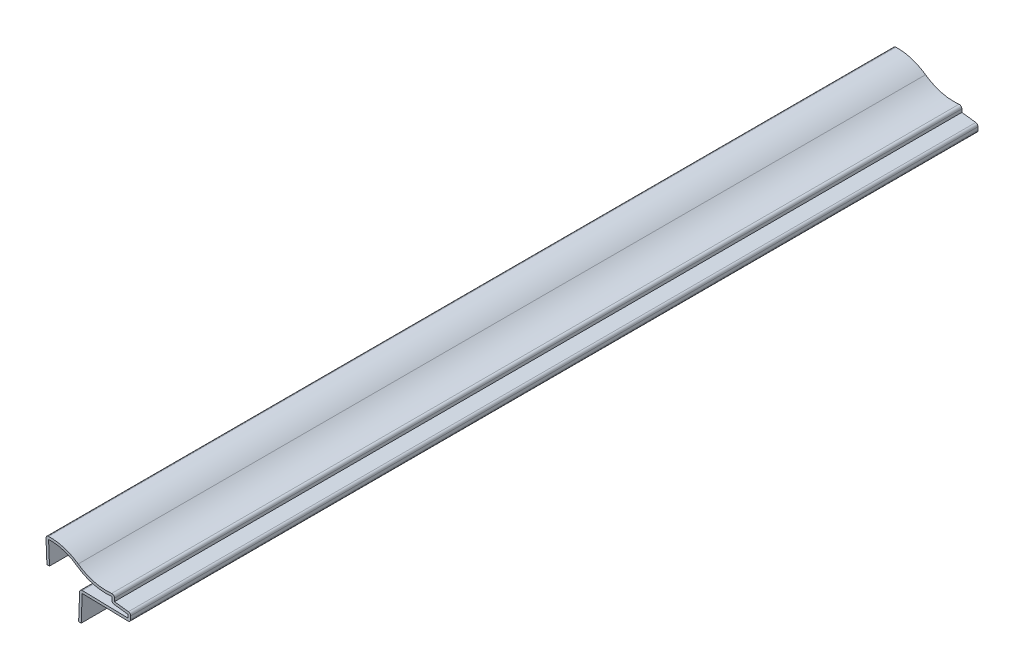
ISO-10303-21;
HEADER;
FILE_DESCRIPTION(('STEP AP214'),'2;1');
FILE_NAME('part.step','',(''),(''),'','','');
FILE_SCHEMA(('AUTOMOTIVE_DESIGN { 1 0 10303 214 1 1 1 1 }'));
ENDSEC;
DATA;
#1=APPLICATION_CONTEXT('core data for automotive mechanical design processes');
#2=APPLICATION_PROTOCOL_DEFINITION('international standard','automotive_design',2000,#1);
#3=PRODUCT_CONTEXT('',#1,'mechanical');
#4=PRODUCT('Part','Part','',(#3));
#5=PRODUCT_RELATED_PRODUCT_CATEGORY('part','',(#4));
#6=PRODUCT_DEFINITION_FORMATION('','',#4);
#7=PRODUCT_DEFINITION_CONTEXT('part definition',#1,'design');
#8=PRODUCT_DEFINITION('design','',#6,#7);
#9=PRODUCT_DEFINITION_SHAPE('','',#8);
#10=(LENGTH_UNIT() NAMED_UNIT(*) SI_UNIT(.MILLI.,.METRE.));
#11=(NAMED_UNIT(*) PLANE_ANGLE_UNIT() SI_UNIT($,.RADIAN.));
#12=(NAMED_UNIT(*) SI_UNIT($,.STERADIAN.) SOLID_ANGLE_UNIT());
#13=UNCERTAINTY_MEASURE_WITH_UNIT(LENGTH_MEASURE(1.E-05),#10,'distance_accuracy_value','');
#14=(GEOMETRIC_REPRESENTATION_CONTEXT(3) GLOBAL_UNCERTAINTY_ASSIGNED_CONTEXT((#13)) GLOBAL_UNIT_ASSIGNED_CONTEXT((#10,
#11,#12)) REPRESENTATION_CONTEXT('',''));
#15=CARTESIAN_POINT('',(0.,0.,0.));
#16=DIRECTION('',(0.,0.,1.));
#17=DIRECTION('',(1.,0.,0.));
#18=AXIS2_PLACEMENT_3D('',#15,#16,#17);
#19=CARTESIAN_POINT('',(12.8753765235632,-2.81339934914993,-333.375));
#20=DIRECTION('',(-0.999260311453509,0.0384555581656976,0.));
#21=DIRECTION('',(-0.0384555581656976,-0.999260311453509,0.));
#22=AXIS2_PLACEMENT_3D('',#19,#20,#21);
#23=PLANE('',#22);
#24=DIRECTION('',(-0.0384555581656976,-0.999260311453509,0.));
#25=VECTOR('',#24,1.);
#26=CARTESIAN_POINT('',(12.8753765235632,-2.81339934914993,0.));
#27=LINE('',#26,#25);
#28=CARTESIAN_POINT('',(12.8753765235632,-2.81339934914993,0.));
#29=VERTEX_POINT('',#28);
#30=CARTESIAN_POINT('',(12.4785015235632,-13.126120189121,0.));
#31=VERTEX_POINT('',#30);
#32=EDGE_CURVE('E354',#29,#31,#27,.T.);
#33=ORIENTED_EDGE('',*,*,#32,.F.);
#34=DIRECTION('',(0.,0.,1.));
#35=VECTOR('',#34,1.);
#36=CARTESIAN_POINT('',(12.8753765235632,-2.81339934914993,-333.375));
#37=LINE('',#36,#35);
#38=CARTESIAN_POINT('',(12.8753765235632,-2.81339934914993,-333.375));
#39=VERTEX_POINT('',#38);
#40=EDGE_CURVE('E204',#29,#39,#37,.F.);
#41=ORIENTED_EDGE('',*,*,#40,.T.);
#42=DIRECTION('',(-0.0384555581656976,-0.999260311453509,0.));
#43=VECTOR('',#42,1.);
#44=CARTESIAN_POINT('',(12.8753765235632,-2.81339934914993,-333.375));
#45=LINE('',#44,#43);
#46=CARTESIAN_POINT('',(12.4785015235632,-13.126120189121,-333.375));
#47=VERTEX_POINT('',#46);
#48=EDGE_CURVE('E197',#39,#47,#45,.T.);
#49=ORIENTED_EDGE('',*,*,#48,.T.);
#50=DIRECTION('',(0.,0.,1.));
#51=VECTOR('',#50,1.);
#52=CARTESIAN_POINT('',(12.4785015235632,-13.126120189121,-333.375));
#53=LINE('',#52,#51);
#54=EDGE_CURVE('E201',#47,#31,#53,.T.);
#55=ORIENTED_EDGE('',*,*,#54,.T.);
#56=EDGE_LOOP('',(#33,#41,#49,#55));
#57=FACE_BOUND('',#56,.T.);
#58=ADVANCED_FACE('F35',(#57),#23,.T.);
#59=CARTESIAN_POINT('',(32.9617870747007,-2.23356561061052,-333.375));
#60=DIRECTION('',(0.0208288136818357,0.999783056728112,0.));
#61=DIRECTION('',(-0.999783056728112,0.0208288136818357,0.));
#62=AXIS2_PLACEMENT_3D('',#59,#60,#61);
#63=PLANE('',#62);
#64=DIRECTION('',(-0.999783056728112,0.0208288136818357,0.));
#65=VECTOR('',#64,1.);
#66=CARTESIAN_POINT('',(32.9617870747007,-2.23356561061052,-333.375));
#67=LINE('',#66,#65);
#68=CARTESIAN_POINT('',(31.924625,-2.21195806738759,-333.375));
#69=VERTEX_POINT('',#68);
#70=CARTESIAN_POINT('',(13.9117870747007,-1.83669061061052,-333.375));
#71=VERTEX_POINT('',#70);
#72=EDGE_CURVE('E221',#69,#71,#67,.T.);
#73=ORIENTED_EDGE('',*,*,#72,.T.);
#74=DIRECTION('',(0.,0.,1.));
#75=VECTOR('',#74,1.);
#76=CARTESIAN_POINT('',(13.9117870747007,-1.83669061061052,-333.375));
#77=LINE('',#76,#75);
#78=CARTESIAN_POINT('',(13.9117870747007,-1.83669061061052,0.));
#79=VERTEX_POINT('',#78);
#80=EDGE_CURVE('E230',#71,#79,#77,.T.);
#81=ORIENTED_EDGE('',*,*,#80,.T.);
#82=DIRECTION('',(-0.999783056728112,0.0208288136818357,0.));
#83=VECTOR('',#82,1.);
#84=CARTESIAN_POINT('',(32.9617870747007,-2.23356561061052,0.));
#85=LINE('',#84,#83);
#86=CARTESIAN_POINT('',(31.924625,-2.21195806738759,0.));
#87=VERTEX_POINT('',#86);
#88=EDGE_CURVE('E207',#87,#79,#85,.T.);
#89=ORIENTED_EDGE('',*,*,#88,.F.);
#90=DIRECTION('',(0.,0.,1.));
#91=VECTOR('',#90,1.);
#92=CARTESIAN_POINT('',(31.924625,-2.21195806738759,-333.375));
#93=LINE('',#92,#91);
#94=EDGE_CURVE('E234',#69,#87,#93,.T.);
#95=ORIENTED_EDGE('',*,*,#94,.F.);
#96=EDGE_LOOP('',(#73,#81,#89,#95));
#97=FACE_BOUND('',#96,.T.);
#98=ADVANCED_FACE('F419',(#97),#63,.T.);
#99=CARTESIAN_POINT('',(31.924625,-0.0743451962462816,-333.375));
#100=DIRECTION('',(-1.,0.,0.));
#101=DIRECTION('',(0.,0.,1.));
#102=AXIS2_PLACEMENT_3D('',#99,#100,#101);
#103=PLANE('',#102);
#104=DIRECTION('',(0.,1.,0.));
#105=VECTOR('',#104,1.);
#106=CARTESIAN_POINT('',(31.924625,-0.0743451962462816,0.));
#107=LINE('',#106,#105);
#108=CARTESIAN_POINT('',(31.924625,-0.971251930280197,0.));
#109=VERTEX_POINT('',#108);
#110=EDGE_CURVE('E319',#109,#87,#107,.F.);
#111=ORIENTED_EDGE('',*,*,#110,.F.);
#112=DIRECTION('',(0.,0.,1.));
#113=VECTOR('',#112,1.);
#114=CARTESIAN_POINT('',(31.924625,-0.971251930280197,-333.375));
#115=LINE('',#114,#113);
#116=CARTESIAN_POINT('',(31.924625,-0.971251930280197,-333.375));
#117=VERTEX_POINT('',#116);
#118=EDGE_CURVE('E324',#117,#109,#115,.T.);
#119=ORIENTED_EDGE('',*,*,#118,.F.);
#120=DIRECTION('',(0.,1.,0.));
#121=VECTOR('',#120,1.);
#122=CARTESIAN_POINT('',(31.924625,-0.0743451962462816,-333.375));
#123=LINE('',#122,#121);
#124=EDGE_CURVE('E226',#117,#69,#123,.F.);
#125=ORIENTED_EDGE('',*,*,#124,.T.);
#126=ORIENTED_EDGE('',*,*,#94,.T.);
#127=EDGE_LOOP('',(#111,#119,#125,#126));
#128=FACE_BOUND('',#127,.T.);
#129=ADVANCED_FACE('F424',(#128),#103,.T.);
#130=CARTESIAN_POINT('',(26.4646057096574,-0.288749518987368,-333.375));
#131=DIRECTION('',(-0.124034734589208,-0.992277876713668,0.));
#132=DIRECTION('',(0.992277876713668,-0.124034734589208,0.));
#133=AXIS2_PLACEMENT_3D('',#130,#131,#132);
#134=PLANE('',#133);
#135=DIRECTION('',(0.992277876713668,-0.124034734589208,0.));
#136=VECTOR('',#135,1.);
#137=CARTESIAN_POINT('',(26.4646057096574,-0.288749518987368,0.));
#138=LINE('',#137,#136);
#139=CARTESIAN_POINT('',(26.4646057096574,-0.288749518987368,0.));
#140=VERTEX_POINT('',#139);
#141=EDGE_CURVE('E317',#140,#109,#138,.T.);
#142=ORIENTED_EDGE('',*,*,#141,.F.);
#143=DIRECTION('',(0.,0.,1.));
#144=VECTOR('',#143,1.);
#145=CARTESIAN_POINT('',(26.4646057096574,-0.288749518987368,-333.375));
#146=LINE('',#145,#144);
#147=CARTESIAN_POINT('',(26.4646057096574,-0.288749518987368,-333.375));
#148=VERTEX_POINT('',#147);
#149=EDGE_CURVE('E261',#140,#148,#146,.F.);
#150=ORIENTED_EDGE('',*,*,#149,.T.);
#151=DIRECTION('',(0.992277876713668,-0.124034734589208,0.));
#152=VECTOR('',#151,1.);
#153=CARTESIAN_POINT('',(26.4646057096574,-0.288749518987368,-333.375));
#154=LINE('',#153,#152);
#155=EDGE_CURVE('E410',#148,#117,#154,.T.);
#156=ORIENTED_EDGE('',*,*,#155,.T.);
#157=ORIENTED_EDGE('',*,*,#118,.T.);
#158=EDGE_LOOP('',(#142,#150,#156,#157));
#159=FACE_BOUND('',#158,.T.);
#160=ADVANCED_FACE('F519',(#159),#134,.T.);
#161=CARTESIAN_POINT('',(25.574625,3.10065480375372,-333.375));
#162=DIRECTION('',(-1.,0.,0.));
#163=DIRECTION('',(0.,0.,1.));
#164=AXIS2_PLACEMENT_3D('',#161,#162,#163);
#165=PLANE('',#164);
#166=DIRECTION('',(0.,1.,0.));
#167=VECTOR('',#166,1.);
#168=CARTESIAN_POINT('',(25.574625,3.10065480375372,-333.375));
#169=LINE('',#168,#167);
#170=CARTESIAN_POINT('',(25.574625,1.93469496314064,-333.375));
#171=VERTEX_POINT('',#170);
#172=CARTESIAN_POINT('',(25.574625,0.719404803753718,-333.375));
#173=VERTEX_POINT('',#172);
#174=EDGE_CURVE('E407',#171,#173,#169,.F.);
#175=ORIENTED_EDGE('',*,*,#174,.T.);
#176=DIRECTION('',(0.,0.,1.));
#177=VECTOR('',#176,1.);
#178=CARTESIAN_POINT('',(25.574625,0.719404803753718,-333.375));
#179=LINE('',#178,#177);
#180=CARTESIAN_POINT('',(25.574625,0.719404803753718,0.));
#181=VERTEX_POINT('',#180);
#182=EDGE_CURVE('E258',#173,#181,#179,.T.);
#183=ORIENTED_EDGE('',*,*,#182,.T.);
#184=DIRECTION('',(0.,1.,0.));
#185=VECTOR('',#184,1.);
#186=CARTESIAN_POINT('',(25.574625,3.10065480375372,0.));
#187=LINE('',#186,#185);
#188=CARTESIAN_POINT('',(25.574625,1.93469496314064,0.));
#189=VERTEX_POINT('',#188);
#190=EDGE_CURVE('E314',#189,#181,#187,.F.);
#191=ORIENTED_EDGE('',*,*,#190,.F.);
#192=DIRECTION('',(0.,0.,1.));
#193=VECTOR('',#192,1.);
#194=CARTESIAN_POINT('',(25.574625,1.93469496314064,-333.375));
#195=LINE('',#194,#193);
#196=EDGE_CURVE('E327',#171,#189,#195,.T.);
#197=ORIENTED_EDGE('',*,*,#196,.F.);
#198=EDGE_LOOP('',(#175,#183,#191,#197));
#199=FACE_BOUND('',#198,.T.);
#200=ADVANCED_FACE('F435',(#199),#165,.T.);
#201=CARTESIAN_POINT('',(23.415625,21.884208115095,-333.375));
#202=DIRECTION('',(0.,0.,1.));
#203=DIRECTION('',(1.,0.,0.));
#204=AXIS2_PLACEMENT_3D('',#201,#202,#203);
#205=CYLINDRICAL_SURFACE('',#204,20.066);
#206=CARTESIAN_POINT('',(23.415625,21.884208115095,0.));
#207=DIRECTION('',(0.,0.,1.));
#208=DIRECTION('',(1.,0.,0.));
#209=AXIS2_PLACEMENT_3D('',#206,#207,#208);
#210=CIRCLE('',#209,20.066);
#211=CARTESIAN_POINT('',(11.7104583333333,5.58594350485028,0.));
#212=VERTEX_POINT('',#211);
#213=EDGE_CURVE('E311',#212,#189,#210,.T.);
#214=ORIENTED_EDGE('',*,*,#213,.F.);
#215=DIRECTION('',(0.,0.,1.));
#216=VECTOR('',#215,1.);
#217=CARTESIAN_POINT('',(11.7104583333333,5.58594350485028,-333.375));
#218=LINE('',#217,#216);
#219=CARTESIAN_POINT('',(11.7104583333333,5.58594350485028,-333.375));
#220=VERTEX_POINT('',#219);
#221=EDGE_CURVE('E329',#220,#212,#218,.T.);
#222=ORIENTED_EDGE('',*,*,#221,.F.);
#223=CARTESIAN_POINT('',(23.415625,21.884208115095,-333.375));
#224=DIRECTION('',(0.,0.,1.));
#225=DIRECTION('',(1.,0.,0.));
#226=AXIS2_PLACEMENT_3D('',#223,#224,#225);
#227=CIRCLE('',#226,20.066);
#228=EDGE_CURVE('E404',#220,#171,#227,.T.);
#229=ORIENTED_EDGE('',*,*,#228,.T.);
#230=ORIENTED_EDGE('',*,*,#196,.T.);
#231=EDGE_LOOP('',(#214,#222,#229,#230));
#232=FACE_BOUND('',#231,.T.);
#233=ADVANCED_FACE('F440',(#232),#205,.T.);
#234=CARTESIAN_POINT('',(1.190625,-9.06186392967347,-333.375));
#235=DIRECTION('',(0.,0.,1.));
#236=DIRECTION('',(1.,0.,0.));
#237=AXIS2_PLACEMENT_3D('',#234,#235,#236);
#238=CYLINDRICAL_SURFACE('',#237,18.034);
#239=CARTESIAN_POINT('',(1.190625,-9.06186392967347,0.));
#240=DIRECTION('',(0.,0.,1.));
#241=DIRECTION('',(1.,0.,0.));
#242=AXIS2_PLACEMENT_3D('',#239,#240,#241);
#243=CIRCLE('',#242,18.034);
#244=CARTESIAN_POINT('',(0.658241431842194,8.96427608244104,0.));
#245=VERTEX_POINT('',#244);
#246=EDGE_CURVE('E308',#245,#212,#243,.F.);
#247=ORIENTED_EDGE('',*,*,#246,.F.);
#248=DIRECTION('',(0.,0.,1.));
#249=VECTOR('',#248,1.);
#250=CARTESIAN_POINT('',(0.658241431842194,8.96427608244104,-333.375));
#251=LINE('',#250,#249);
#252=CARTESIAN_POINT('',(0.658241431842194,8.96427608244104,-333.375));
#253=VERTEX_POINT('',#252);
#254=EDGE_CURVE('E331',#253,#245,#251,.T.);
#255=ORIENTED_EDGE('',*,*,#254,.F.);
#256=CARTESIAN_POINT('',(1.190625,-9.06186392967347,-333.375));
#257=DIRECTION('',(0.,0.,1.));
#258=DIRECTION('',(1.,0.,0.));
#259=AXIS2_PLACEMENT_3D('',#256,#257,#258);
#260=CIRCLE('',#259,18.034);
#261=EDGE_CURVE('E401',#253,#220,#260,.F.);
#262=ORIENTED_EDGE('',*,*,#261,.T.);
#263=ORIENTED_EDGE('',*,*,#221,.T.);
#264=EDGE_LOOP('',(#247,#255,#262,#263));
#265=FACE_BOUND('',#264,.T.);
#266=ADVANCED_FACE('F445',(#265),#238,.F.);
#267=CARTESIAN_POINT('',(1.01518817406134,0.0406075269624536,-333.375));
#268=DIRECTION('',(0.999200958721789,0.0399680383488717,0.));
#269=DIRECTION('',(-0.0399680383488717,0.999200958721789,0.));
#270=AXIS2_PLACEMENT_3D('',#267,#268,#269);
#271=PLANE('',#270);
#272=DIRECTION('',(-0.0399680383488717,0.999200958721789,0.));
#273=VECTOR('',#272,1.);
#274=CARTESIAN_POINT('',(1.01518817406134,0.0406075269624536,0.));
#275=LINE('',#274,#273);
#276=CARTESIAN_POINT('',(1.01518817406134,0.0406075269624536,0.));
#277=VERTEX_POINT('',#276);
#278=EDGE_CURVE('E305',#277,#245,#275,.T.);
#279=ORIENTED_EDGE('',*,*,#278,.F.);
#280=DIRECTION('',(0.,0.,1.));
#281=VECTOR('',#280,1.);
#282=CARTESIAN_POINT('',(1.01518817406134,0.0406075269624536,-333.375));
#283=LINE('',#282,#281);
#284=CARTESIAN_POINT('',(1.01518817406134,0.0406075269624536,-333.375));
#285=VERTEX_POINT('',#284);
#286=EDGE_CURVE('E333',#285,#277,#283,.T.);
#287=ORIENTED_EDGE('',*,*,#286,.F.);
#288=DIRECTION('',(-0.0399680383488717,0.999200958721789,0.));
#289=VECTOR('',#288,1.);
#290=CARTESIAN_POINT('',(1.01518817406134,0.0406075269624536,-333.375));
#291=LINE('',#290,#289);
#292=EDGE_CURVE('E398',#285,#253,#291,.T.);
#293=ORIENTED_EDGE('',*,*,#292,.T.);
#294=ORIENTED_EDGE('',*,*,#254,.T.);
#295=EDGE_LOOP('',(#279,#287,#293,#294));
#296=FACE_BOUND('',#295,.T.);
#297=ADVANCED_FACE('F448',(#296),#271,.T.);
#298=CARTESIAN_POINT('',(1.01518817406134,0.0406075269624536,-333.375));
#299=DIRECTION('',(-0.0399680383488717,0.999200958721789,0.));
#300=DIRECTION('',(-0.999200958721789,-0.0399680383488717,0.));
#301=AXIS2_PLACEMENT_3D('',#298,#299,#300);
#302=PLANE('',#301);
#303=DIRECTION('',(-0.999200958721789,-0.0399680383488717,0.));
#304=VECTOR('',#303,1.);
#305=CARTESIAN_POINT('',(1.01518817406134,0.0406075269624536,0.));
#306=LINE('',#305,#304);
#307=CARTESIAN_POINT('',(0.,0.,0.));
#308=VERTEX_POINT('',#307);
#309=EDGE_CURVE('E298',#277,#308,#306,.T.);
#310=ORIENTED_EDGE('',*,*,#309,.T.);
#311=DIRECTION('',(0.,0.,1.));
#312=VECTOR('',#311,1.);
#313=CARTESIAN_POINT('',(0.,0.,-333.375));
#314=LINE('',#313,#312);
#315=CARTESIAN_POINT('',(0.,0.,-333.375));
#316=VERTEX_POINT('',#315);
#317=EDGE_CURVE('E335',#316,#308,#314,.T.);
#318=ORIENTED_EDGE('',*,*,#317,.F.);
#319=DIRECTION('',(-0.999200958721789,-0.0399680383488717,0.));
#320=VECTOR('',#319,1.);
#321=CARTESIAN_POINT('',(1.01518817406134,0.0406075269624536,-333.375));
#322=LINE('',#321,#320);
#323=EDGE_CURVE('E396',#285,#316,#322,.T.);
#324=ORIENTED_EDGE('',*,*,#323,.F.);
#325=ORIENTED_EDGE('',*,*,#286,.T.);
#326=EDGE_LOOP('',(#310,#318,#324,#325));
#327=FACE_BOUND('',#326,.T.);
#328=ADVANCED_FACE('F453',(#327),#302,.F.);
#329=CARTESIAN_POINT('',(0.,0.,-333.375));
#330=DIRECTION('',(0.999200958721789,0.0399680383488717,0.));
#331=DIRECTION('',(-0.0399680383488717,0.99920095872179,0.));
#332=AXIS2_PLACEMENT_3D('',#329,#330,#331);
#333=PLANE('',#332);
#334=DIRECTION('',(-0.0399680383488717,0.99920095872179,0.));
#335=VECTOR('',#334,1.);
#336=CARTESIAN_POINT('',(0.,0.,0.));
#337=LINE('',#336,#335);
#338=CARTESIAN_POINT('',(-0.356946742219144,8.92366855547858,0.));
#339=VERTEX_POINT('',#338);
#340=EDGE_CURVE('E296',#308,#339,#337,.T.);
#341=ORIENTED_EDGE('',*,*,#340,.T.);
#342=DIRECTION('',(0.,0.,1.));
#343=VECTOR('',#342,1.);
#344=CARTESIAN_POINT('',(-0.356946742219144,8.92366855547858,-333.375));
#345=LINE('',#344,#343);
#346=CARTESIAN_POINT('',(-0.356946742219144,8.92366855547858,-333.375));
#347=VERTEX_POINT('',#346);
#348=EDGE_CURVE('E11',#339,#347,#345,.F.);
#349=ORIENTED_EDGE('',*,*,#348,.T.);
#350=DIRECTION('',(-0.0399680383488717,0.99920095872179,0.));
#351=VECTOR('',#350,1.);
#352=CARTESIAN_POINT('',(0.,0.,-333.375));
#353=LINE('',#352,#351);
#354=EDGE_CURVE('E393',#316,#347,#353,.T.);
#355=ORIENTED_EDGE('',*,*,#354,.F.);
#356=ORIENTED_EDGE('',*,*,#317,.T.);
#357=EDGE_LOOP('',(#341,#349,#355,#356));
#358=FACE_BOUND('',#357,.T.);
#359=ADVANCED_FACE('F456',(#358),#333,.F.);
#360=CARTESIAN_POINT('',(1.190625,-9.06186392967347,-333.375));
#361=DIRECTION('',(0.,0.,1.));
#362=DIRECTION('',(1.,0.,0.));
#363=AXIS2_PLACEMENT_3D('',#360,#361,#362);
#364=CYLINDRICAL_SURFACE('',#363,19.05);
#365=CARTESIAN_POINT('',(1.190625,-9.06186392967347,-333.375));
#366=DIRECTION('',(0.,0.,-1.));
#367=DIRECTION('',(-1.,0.,0.));
#368=AXIS2_PLACEMENT_3D('',#365,#366,#367);
#369=CIRCLE('',#368,19.05);
#370=CARTESIAN_POINT('',(0.628247991382599,9.97983326622214,-333.375));
#371=VERTEX_POINT('',#370);
#372=CARTESIAN_POINT('',(12.303125,6.41117209271076,-333.375));
#373=VERTEX_POINT('',#372);
#374=EDGE_CURVE('E285',#371,#373,#369,.T.);
#375=ORIENTED_EDGE('',*,*,#374,.F.);
#376=DIRECTION('',(0.,0.,1.));
#377=VECTOR('',#376,1.);
#378=CARTESIAN_POINT('',(0.628247991382599,9.97983326622214,-333.375));
#379=LINE('',#378,#377);
#380=CARTESIAN_POINT('',(0.628247991382599,9.97983326622214,0.));
#381=VERTEX_POINT('',#380);
#382=EDGE_CURVE('E43',#371,#381,#379,.T.);
#383=ORIENTED_EDGE('',*,*,#382,.T.);
#384=CARTESIAN_POINT('',(1.190625,-9.06186392967347,0.));
#385=DIRECTION('',(0.,0.,-1.));
#386=DIRECTION('',(-1.,0.,0.));
#387=AXIS2_PLACEMENT_3D('',#384,#385,#386);
#388=CIRCLE('',#387,19.05);
#389=CARTESIAN_POINT('',(12.303125,6.41117209271076,0.));
#390=VERTEX_POINT('',#389);
#391=EDGE_CURVE('E283',#381,#390,#388,.T.);
#392=ORIENTED_EDGE('',*,*,#391,.T.);
#393=DIRECTION('',(0.,0.,1.));
#394=VECTOR('',#393,1.);
#395=CARTESIAN_POINT('',(12.303125,6.41117209271076,-333.375));
#396=LINE('',#395,#394);
#397=EDGE_CURVE('E338',#373,#390,#396,.T.);
#398=ORIENTED_EDGE('',*,*,#397,.F.);
#399=EDGE_LOOP('',(#375,#383,#392,#398));
#400=FACE_BOUND('',#399,.T.);
#401=ADVANCED_FACE('F281',(#400),#364,.T.);
#402=CARTESIAN_POINT('',(23.415625,21.884208115095,-333.375));
#403=DIRECTION('',(0.,0.,1.));
#404=DIRECTION('',(1.,0.,0.));
#405=AXIS2_PLACEMENT_3D('',#402,#403,#404);
#406=CYLINDRICAL_SURFACE('',#405,19.05);
#407=CARTESIAN_POINT('',(23.415625,21.884208115095,0.));
#408=DIRECTION('',(0.,0.,1.));
#409=DIRECTION('',(1.,0.,0.));
#410=AXIS2_PLACEMENT_3D('',#407,#408,#409);
#411=CIRCLE('',#410,19.05);
#412=CARTESIAN_POINT('',(25.4653085443038,2.94479689488516,0.));
#413=VERTEX_POINT('',#412);
#414=EDGE_CURVE('E295',#390,#413,#411,.T.);
#415=ORIENTED_EDGE('',*,*,#414,.T.);
#416=DIRECTION('',(0.,0.,1.));
#417=VECTOR('',#416,1.);
#418=CARTESIAN_POINT('',(25.4653085443038,2.94479689488516,-333.375));
#419=LINE('',#418,#417);
#420=CARTESIAN_POINT('',(25.4653085443038,2.94479689488516,-333.375));
#421=VERTEX_POINT('',#420);
#422=EDGE_CURVE('E275',#413,#421,#419,.F.);
#423=ORIENTED_EDGE('',*,*,#422,.T.);
#424=CARTESIAN_POINT('',(23.415625,21.884208115095,-333.375));
#425=DIRECTION('',(0.,0.,1.));
#426=DIRECTION('',(1.,0.,0.));
#427=AXIS2_PLACEMENT_3D('',#424,#425,#426);
#428=CIRCLE('',#427,19.05);
#429=EDGE_CURVE('E389',#373,#421,#428,.T.);
#430=ORIENTED_EDGE('',*,*,#429,.F.);
#431=ORIENTED_EDGE('',*,*,#397,.T.);
#432=EDGE_LOOP('',(#415,#423,#430,#431));
#433=FACE_BOUND('',#432,.T.);
#434=ADVANCED_FACE('F461',(#433),#406,.F.);
#435=CARTESIAN_POINT('',(26.590625,3.10065480375372,-333.375));
#436=DIRECTION('',(-1.,0.,0.));
#437=DIRECTION('',(0.,0.,1.));
#438=AXIS2_PLACEMENT_3D('',#435,#436,#437);
#439=PLANE('',#438);
#440=DIRECTION('',(0.,-1.,0.));
#441=VECTOR('',#440,1.);
#442=CARTESIAN_POINT('',(26.590625,3.10065480375372,-333.375));
#443=LINE('',#442,#441);
#444=CARTESIAN_POINT('',(26.590625,1.93469496314064,-333.375));
#445=VERTEX_POINT('',#444);
#446=CARTESIAN_POINT('',(26.590625,0.719404803753718,-333.375));
#447=VERTEX_POINT('',#446);
#448=EDGE_CURVE('E383',#445,#447,#443,.T.);
#449=ORIENTED_EDGE('',*,*,#448,.F.);
#450=DIRECTION('',(0.,0.,1.));
#451=VECTOR('',#450,1.);
#452=CARTESIAN_POINT('',(26.590625,1.93469496314064,-333.375));
#453=LINE('',#452,#451);
#454=CARTESIAN_POINT('',(26.590625,1.93469496314064,0.));
#455=VERTEX_POINT('',#454);
#456=EDGE_CURVE('E272',#445,#455,#453,.T.);
#457=ORIENTED_EDGE('',*,*,#456,.T.);
#458=DIRECTION('',(0.,-1.,0.));
#459=VECTOR('',#458,1.);
#460=CARTESIAN_POINT('',(26.590625,3.10065480375372,0.));
#461=LINE('',#460,#459);
#462=CARTESIAN_POINT('',(26.590625,0.719404803753718,0.));
#463=VERTEX_POINT('',#462);
#464=EDGE_CURVE('E300',#455,#463,#461,.T.);
#465=ORIENTED_EDGE('',*,*,#464,.T.);
#466=DIRECTION('',(0.,0.,1.));
#467=VECTOR('',#466,1.);
#468=CARTESIAN_POINT('',(26.590625,0.719404803753718,-333.375));
#469=LINE('',#468,#467);
#470=EDGE_CURVE('E340',#447,#463,#469,.T.);
#471=ORIENTED_EDGE('',*,*,#470,.F.);
#472=EDGE_LOOP('',(#449,#457,#465,#471));
#473=FACE_BOUND('',#472,.T.);
#474=ADVANCED_FACE('F365',(#473),#439,.F.);
#475=CARTESIAN_POINT('',(26.590625,0.719404803753718,-333.375));
#476=DIRECTION('',(-0.124034734589208,-0.992277876713668,0.));
#477=DIRECTION('',(0.992277876713668,-0.124034734589208,0.));
#478=AXIS2_PLACEMENT_3D('',#475,#476,#477);
#479=PLANE('',#478);
#480=DIRECTION('',(0.992277876713668,-0.124034734589208,0.));
#481=VECTOR('',#480,1.);
#482=CARTESIAN_POINT('',(26.590625,0.719404803753718,0.));
#483=LINE('',#482,#481);
#484=CARTESIAN_POINT('',(32.0506442903426,0.0369023924608891,0.));
#485=VERTEX_POINT('',#484);
#486=EDGE_CURVE('E359',#463,#485,#483,.T.);
#487=ORIENTED_EDGE('',*,*,#486,.T.);
#488=DIRECTION('',(0.,0.,1.));
#489=VECTOR('',#488,1.);
#490=CARTESIAN_POINT('',(32.0506442903426,0.0369023924608892,-333.375));
#491=LINE('',#490,#489);
#492=CARTESIAN_POINT('',(32.0506442903426,0.0369023924608891,-333.375));
#493=VERTEX_POINT('',#492);
#494=EDGE_CURVE('E270',#485,#493,#491,.F.);
#495=ORIENTED_EDGE('',*,*,#494,.T.);
#496=DIRECTION('',(0.992277876713668,-0.124034734589208,0.));
#497=VECTOR('',#496,1.);
#498=CARTESIAN_POINT('',(26.590625,0.719404803753718,-333.375));
#499=LINE('',#498,#497);
#500=EDGE_CURVE('E373',#447,#493,#499,.T.);
#501=ORIENTED_EDGE('',*,*,#500,.F.);
#502=ORIENTED_EDGE('',*,*,#470,.T.);
#503=EDGE_LOOP('',(#487,#495,#501,#502));
#504=FACE_BOUND('',#503,.T.);
#505=ADVANCED_FACE('F370',(#504),#479,.F.);
#506=CARTESIAN_POINT('',(32.940625,-0.0743451962462816,-333.375));
#507=DIRECTION('',(-1.,0.,0.));
#508=DIRECTION('',(0.,0.,1.));
#509=AXIS2_PLACEMENT_3D('',#506,#507,#508);
#510=PLANE('',#509);
#511=DIRECTION('',(0.,-1.,0.));
#512=VECTOR('',#511,1.);
#513=CARTESIAN_POINT('',(32.940625,-0.0743451962462816,0.));
#514=LINE('',#513,#512);
#515=CARTESIAN_POINT('',(32.940625,-0.971251930280197,0.));
#516=VERTEX_POINT('',#515);
#517=CARTESIAN_POINT('',(32.940625,-2.21195806738759,0.));
#518=VERTEX_POINT('',#517);
#519=EDGE_CURVE('E352',#516,#518,#514,.T.);
#520=ORIENTED_EDGE('',*,*,#519,.T.);
#521=DIRECTION('',(0.,0.,1.));
#522=VECTOR('',#521,1.);
#523=CARTESIAN_POINT('',(32.940625,-2.21195806738759,-333.375));
#524=LINE('',#523,#522);
#525=CARTESIAN_POINT('',(32.940625,-2.21195806738759,-333.375));
#526=VERTEX_POINT('',#525);
#527=EDGE_CURVE('E58',#518,#526,#524,.F.);
#528=ORIENTED_EDGE('',*,*,#527,.T.);
#529=DIRECTION('',(0.,-1.,0.));
#530=VECTOR('',#529,1.);
#531=CARTESIAN_POINT('',(32.940625,-0.0743451962462816,-333.375));
#532=LINE('',#531,#530);
#533=CARTESIAN_POINT('',(32.940625,-0.971251930280197,-333.375));
#534=VERTEX_POINT('',#533);
#535=EDGE_CURVE('E380',#534,#526,#532,.T.);
#536=ORIENTED_EDGE('',*,*,#535,.F.);
#537=DIRECTION('',(0.,0.,1.));
#538=VECTOR('',#537,1.);
#539=CARTESIAN_POINT('',(32.940625,-0.971251930280197,-333.375));
#540=LINE('',#539,#538);
#541=EDGE_CURVE('E266',#534,#516,#540,.T.);
#542=ORIENTED_EDGE('',*,*,#541,.T.);
#543=EDGE_LOOP('',(#520,#528,#536,#542));
#544=FACE_BOUND('',#543,.T.);
#545=ADVANCED_FACE('F379',(#544),#510,.F.);
#546=CARTESIAN_POINT('',(32.940625,-3.24934519624628,-333.375));
#547=DIRECTION('',(0.0208288136818357,0.999783056728112,0.));
#548=DIRECTION('',(-0.999783056728112,0.0208288136818357,0.));
#549=AXIS2_PLACEMENT_3D('',#546,#547,#548);
#550=PLANE('',#549);
#551=DIRECTION('',(-0.999783056728112,0.0208288136818357,0.));
#552=VECTOR('',#551,1.);
#553=CARTESIAN_POINT('',(32.940625,-3.24934519624628,-333.375));
#554=LINE('',#553,#552);
#555=CARTESIAN_POINT('',(31.9034629252993,-3.22773765302335,-333.375));
#556=VERTEX_POINT('',#555);
#557=CARTESIAN_POINT('',(13.890625,-2.85247019624628,-333.375));
#558=VERTEX_POINT('',#557);
#559=EDGE_CURVE('E381',#556,#558,#554,.T.);
#560=ORIENTED_EDGE('',*,*,#559,.F.);
#561=DIRECTION('',(0.,0.,1.));
#562=VECTOR('',#561,1.);
#563=CARTESIAN_POINT('',(31.9034629252993,-3.22773765302335,-333.375));
#564=LINE('',#563,#562);
#565=CARTESIAN_POINT('',(31.9034629252993,-3.22773765302335,0.));
#566=VERTEX_POINT('',#565);
#567=EDGE_CURVE('E263',#556,#566,#564,.T.);
#568=ORIENTED_EDGE('',*,*,#567,.T.);
#569=DIRECTION('',(-0.999783056728112,0.0208288136818357,0.));
#570=VECTOR('',#569,1.);
#571=CARTESIAN_POINT('',(32.940625,-3.24934519624628,0.));
#572=LINE('',#571,#570);
#573=CARTESIAN_POINT('',(13.890625,-2.85247019624628,0.));
#574=VERTEX_POINT('',#573);
#575=EDGE_CURVE('E350',#566,#574,#572,.T.);
#576=ORIENTED_EDGE('',*,*,#575,.T.);
#577=DIRECTION('',(0.,0.,1.));
#578=VECTOR('',#577,1.);
#579=CARTESIAN_POINT('',(13.890625,-2.85247019624628,-333.375));
#580=LINE('',#579,#578);
#581=EDGE_CURVE('E223',#558,#574,#580,.T.);
#582=ORIENTED_EDGE('',*,*,#581,.F.);
#583=EDGE_LOOP('',(#560,#568,#576,#582));
#584=FACE_BOUND('',#583,.T.);
#585=ADVANCED_FACE('F490',(#584),#550,.F.);
#586=CARTESIAN_POINT('',(13.890625,-2.85247019624628,-333.375));
#587=DIRECTION('',(-0.999260311453509,0.0384555581656976,0.));
#588=DIRECTION('',(-0.0384555581656976,-0.999260311453509,0.));
#589=AXIS2_PLACEMENT_3D('',#586,#587,#588);
#590=PLANE('',#589);
#591=DIRECTION('',(-0.0384555581656976,-0.999260311453509,0.));
#592=VECTOR('',#591,1.);
#593=CARTESIAN_POINT('',(13.890625,-2.85247019624628,0.));
#594=LINE('',#593,#592);
#595=CARTESIAN_POINT('',(13.49375,-13.1651910362174,0.));
#596=VERTEX_POINT('',#595);
#597=EDGE_CURVE('E347',#574,#596,#594,.T.);
#598=ORIENTED_EDGE('',*,*,#597,.T.);
#599=DIRECTION('',(0.,0.,1.));
#600=VECTOR('',#599,1.);
#601=CARTESIAN_POINT('',(13.49375,-13.1651910362174,-333.375));
#602=LINE('',#601,#600);
#603=CARTESIAN_POINT('',(13.49375,-13.1651910362174,-333.375));
#604=VERTEX_POINT('',#603);
#605=EDGE_CURVE('E220',#604,#596,#602,.T.);
#606=ORIENTED_EDGE('',*,*,#605,.F.);
#607=DIRECTION('',(-0.0384555581656976,-0.999260311453509,0.));
#608=VECTOR('',#607,1.);
#609=CARTESIAN_POINT('',(13.890625,-2.85247019624628,-333.375));
#610=LINE('',#609,#608);
#611=EDGE_CURVE('E212',#558,#604,#610,.T.);
#612=ORIENTED_EDGE('',*,*,#611,.F.);
#613=ORIENTED_EDGE('',*,*,#581,.T.);
#614=EDGE_LOOP('',(#598,#606,#612,#613));
#615=FACE_BOUND('',#614,.T.);
#616=ADVANCED_FACE('F346',(#615),#590,.F.);
#617=CARTESIAN_POINT('',(13.49375,-13.1651910362174,-333.375));
#618=DIRECTION('',(0.0384555581656972,0.999260311453509,0.));
#619=DIRECTION('',(-0.999260311453509,0.0384555581656972,0.));
#620=AXIS2_PLACEMENT_3D('',#617,#618,#619);
#621=PLANE('',#620);
#622=DIRECTION('',(-0.999260311453509,0.0384555581656972,0.));
#623=VECTOR('',#622,1.);
#624=CARTESIAN_POINT('',(13.49375,-13.1651910362174,0.));
#625=LINE('',#624,#623);
#626=EDGE_CURVE('E219',#596,#31,#625,.T.);
#627=ORIENTED_EDGE('',*,*,#626,.T.);
#628=ORIENTED_EDGE('',*,*,#54,.F.);
#629=DIRECTION('',(-0.999260311453509,0.0384555581656972,0.));
#630=VECTOR('',#629,1.);
#631=CARTESIAN_POINT('',(13.49375,-13.1651910362174,-333.375));
#632=LINE('',#631,#630);
#633=EDGE_CURVE('E206',#604,#47,#632,.T.);
#634=ORIENTED_EDGE('',*,*,#633,.F.);
#635=ORIENTED_EDGE('',*,*,#605,.T.);
#636=EDGE_LOOP('',(#627,#628,#634,#635));
#637=FACE_BOUND('',#636,.T.);
#638=ADVANCED_FACE('F217',(#637),#621,.F.);
#639=CARTESIAN_POINT('',(23.415625,21.884208115095,-333.375));
#640=DIRECTION('',(0.,0.,1.));
#641=DIRECTION('',(1.,0.,0.));
#642=AXIS2_PLACEMENT_3D('',#639,#640,#641);
#643=PLANE('',#642);
#644=ORIENTED_EDGE('',*,*,#48,.F.);
#645=CARTESIAN_POINT('',(13.890625,-2.85247019624628,-333.375));
#646=DIRECTION('',(0.,0.,1.));
#647=DIRECTION('',(1.,0.,0.));
#648=AXIS2_PLACEMENT_3D('',#645,#646,#647);
#649=CIRCLE('',#648,1.016);
#650=EDGE_CURVE('E256',#39,#71,#649,.F.);
#651=ORIENTED_EDGE('',*,*,#650,.T.);
#652=ORIENTED_EDGE('',*,*,#72,.F.);
#653=ORIENTED_EDGE('',*,*,#124,.F.);
#654=ORIENTED_EDGE('',*,*,#155,.F.);
#655=CARTESIAN_POINT('',(26.590625,0.719404803753718,-333.375));
#656=DIRECTION('',(0.,0.,1.));
#657=DIRECTION('',(1.,0.,0.));
#658=AXIS2_PLACEMENT_3D('',#655,#656,#657);
#659=CIRCLE('',#658,1.016);
#660=EDGE_CURVE('E254',#148,#173,#659,.F.);
#661=ORIENTED_EDGE('',*,*,#660,.T.);
#662=ORIENTED_EDGE('',*,*,#174,.F.);
#663=ORIENTED_EDGE('',*,*,#228,.F.);
#664=ORIENTED_EDGE('',*,*,#261,.F.);
#665=ORIENTED_EDGE('',*,*,#292,.F.);
#666=ORIENTED_EDGE('',*,*,#323,.T.);
#667=ORIENTED_EDGE('',*,*,#354,.T.);
#668=CARTESIAN_POINT('',(0.658241431842194,8.96427608244103,-333.375));
#669=DIRECTION('',(0.,0.,1.));
#670=DIRECTION('',(1.,0.,0.));
#671=AXIS2_PLACEMENT_3D('',#668,#669,#670);
#672=CIRCLE('',#671,1.016);
#673=EDGE_CURVE('E247',#347,#371,#672,.F.);
#674=ORIENTED_EDGE('',*,*,#673,.T.);
#675=ORIENTED_EDGE('',*,*,#374,.T.);
#676=ORIENTED_EDGE('',*,*,#429,.T.);
#677=CARTESIAN_POINT('',(25.574625,1.93469496314064,-333.375));
#678=DIRECTION('',(0.,0.,1.));
#679=DIRECTION('',(1.,0.,0.));
#680=AXIS2_PLACEMENT_3D('',#677,#678,#679);
#681=CIRCLE('',#680,1.016);
#682=EDGE_CURVE('E249',#421,#445,#681,.F.);
#683=ORIENTED_EDGE('',*,*,#682,.T.);
#684=ORIENTED_EDGE('',*,*,#448,.T.);
#685=ORIENTED_EDGE('',*,*,#500,.T.);
#686=CARTESIAN_POINT('',(31.924625,-0.971251930280197,-333.375));
#687=DIRECTION('',(0.,0.,1.));
#688=DIRECTION('',(1.,0.,0.));
#689=AXIS2_PLACEMENT_3D('',#686,#687,#688);
#690=CIRCLE('',#689,1.016);
#691=EDGE_CURVE('E251',#493,#534,#690,.F.);
#692=ORIENTED_EDGE('',*,*,#691,.T.);
#693=ORIENTED_EDGE('',*,*,#535,.T.);
#694=CARTESIAN_POINT('',(31.924625,-2.21195806738759,-333.375));
#695=DIRECTION('',(0.,0.,1.));
#696=DIRECTION('',(1.,0.,0.));
#697=AXIS2_PLACEMENT_3D('',#694,#695,#696);
#698=CIRCLE('',#697,1.016);
#699=EDGE_CURVE('E50',#526,#556,#698,.F.);
#700=ORIENTED_EDGE('',*,*,#699,.T.);
#701=ORIENTED_EDGE('',*,*,#559,.T.);
#702=ORIENTED_EDGE('',*,*,#611,.T.);
#703=ORIENTED_EDGE('',*,*,#633,.T.);
#704=EDGE_LOOP('',(#644,#651,#652,#653,#654,#661,#662,#663,#664,#665,#666,#667,#674,#675,#676,
#683,#684,#685,#692,#693,#700,#701,#702,#703));
#705=FACE_BOUND('',#704,.T.);
#706=ADVANCED_FACE('F210',(#705),#643,.F.);
#707=CARTESIAN_POINT('',(23.415625,21.884208115095,0.));
#708=DIRECTION('',(0.,0.,1.));
#709=DIRECTION('',(1.,0.,0.));
#710=AXIS2_PLACEMENT_3D('',#707,#708,#709);
#711=PLANE('',#710);
#712=ORIENTED_EDGE('',*,*,#88,.T.);
#713=CARTESIAN_POINT('',(13.890625,-2.85247019624628,0.));
#714=DIRECTION('',(0.,0.,1.));
#715=DIRECTION('',(1.,0.,0.));
#716=AXIS2_PLACEMENT_3D('',#713,#714,#715);
#717=CIRCLE('',#716,1.016);
#718=EDGE_CURVE('E244',#79,#29,#717,.T.);
#719=ORIENTED_EDGE('',*,*,#718,.T.);
#720=ORIENTED_EDGE('',*,*,#32,.T.);
#721=ORIENTED_EDGE('',*,*,#626,.F.);
#722=ORIENTED_EDGE('',*,*,#597,.F.);
#723=ORIENTED_EDGE('',*,*,#575,.F.);
#724=CARTESIAN_POINT('',(31.924625,-2.21195806738759,0.));
#725=DIRECTION('',(0.,0.,1.));
#726=DIRECTION('',(1.,0.,0.));
#727=AXIS2_PLACEMENT_3D('',#724,#725,#726);
#728=CIRCLE('',#727,1.016);
#729=EDGE_CURVE('E240',#566,#518,#728,.T.);
#730=ORIENTED_EDGE('',*,*,#729,.T.);
#731=ORIENTED_EDGE('',*,*,#519,.F.);
#732=CARTESIAN_POINT('',(31.924625,-0.971251930280197,0.));
#733=DIRECTION('',(0.,0.,1.));
#734=DIRECTION('',(1.,0.,0.));
#735=AXIS2_PLACEMENT_3D('',#732,#733,#734);
#736=CIRCLE('',#735,1.016);
#737=EDGE_CURVE('E238',#516,#485,#736,.T.);
#738=ORIENTED_EDGE('',*,*,#737,.T.);
#739=ORIENTED_EDGE('',*,*,#486,.F.);
#740=ORIENTED_EDGE('',*,*,#464,.F.);
#741=CARTESIAN_POINT('',(25.574625,1.93469496314064,0.));
#742=DIRECTION('',(0.,0.,1.));
#743=DIRECTION('',(1.,0.,0.));
#744=AXIS2_PLACEMENT_3D('',#741,#742,#743);
#745=CIRCLE('',#744,1.016);
#746=EDGE_CURVE('E236',#455,#413,#745,.T.);
#747=ORIENTED_EDGE('',*,*,#746,.T.);
#748=ORIENTED_EDGE('',*,*,#414,.F.);
#749=ORIENTED_EDGE('',*,*,#391,.F.);
#750=CARTESIAN_POINT('',(0.658241431842194,8.96427608244103,0.));
#751=DIRECTION('',(0.,0.,1.));
#752=DIRECTION('',(1.,0.,0.));
#753=AXIS2_PLACEMENT_3D('',#750,#751,#752);
#754=CIRCLE('',#753,1.016);
#755=EDGE_CURVE('E233',#381,#339,#754,.T.);
#756=ORIENTED_EDGE('',*,*,#755,.T.);
#757=ORIENTED_EDGE('',*,*,#340,.F.);
#758=ORIENTED_EDGE('',*,*,#309,.F.);
#759=ORIENTED_EDGE('',*,*,#278,.T.);
#760=ORIENTED_EDGE('',*,*,#246,.T.);
#761=ORIENTED_EDGE('',*,*,#213,.T.);
#762=ORIENTED_EDGE('',*,*,#190,.T.);
#763=CARTESIAN_POINT('',(26.590625,0.719404803753718,0.));
#764=DIRECTION('',(0.,0.,1.));
#765=DIRECTION('',(1.,0.,0.));
#766=AXIS2_PLACEMENT_3D('',#763,#764,#765);
#767=CIRCLE('',#766,1.016);
#768=EDGE_CURVE('E242',#181,#140,#767,.T.);
#769=ORIENTED_EDGE('',*,*,#768,.T.);
#770=ORIENTED_EDGE('',*,*,#141,.T.);
#771=ORIENTED_EDGE('',*,*,#110,.T.);
#772=EDGE_LOOP('',(#712,#719,#720,#721,#722,#723,#730,#731,#738,#739,#740,#747,#748,#749,#756,
#757,#758,#759,#760,#761,#762,#769,#770,#771));
#773=FACE_BOUND('',#772,.T.);
#774=ADVANCED_FACE('F291',(#773),#711,.T.);
#775=CARTESIAN_POINT('',(13.890625,-2.85247019624628,-333.375));
#776=DIRECTION('',(0.,0.,1.));
#777=DIRECTION('',(1.,0.,0.));
#778=AXIS2_PLACEMENT_3D('',#775,#776,#777);
#779=CYLINDRICAL_SURFACE('',#778,1.016);
#780=ORIENTED_EDGE('',*,*,#650,.F.);
#781=ORIENTED_EDGE('',*,*,#40,.F.);
#782=ORIENTED_EDGE('',*,*,#718,.F.);
#783=ORIENTED_EDGE('',*,*,#80,.F.);
#784=EDGE_LOOP('',(#780,#781,#782,#783));
#785=FACE_BOUND('',#784,.T.);
#786=ADVANCED_FACE('F414',(#785),#779,.T.);
#787=CARTESIAN_POINT('',(26.590625,0.719404803753718,-333.375));
#788=DIRECTION('',(0.,0.,1.));
#789=DIRECTION('',(1.,0.,0.));
#790=AXIS2_PLACEMENT_3D('',#787,#788,#789);
#791=CYLINDRICAL_SURFACE('',#790,1.016);
#792=ORIENTED_EDGE('',*,*,#660,.F.);
#793=ORIENTED_EDGE('',*,*,#149,.F.);
#794=ORIENTED_EDGE('',*,*,#768,.F.);
#795=ORIENTED_EDGE('',*,*,#182,.F.);
#796=EDGE_LOOP('',(#792,#793,#794,#795));
#797=FACE_BOUND('',#796,.T.);
#798=ADVANCED_FACE('F432',(#797),#791,.T.);
#799=CARTESIAN_POINT('',(31.924625,-2.21195806738759,-333.375));
#800=DIRECTION('',(0.,0.,1.));
#801=DIRECTION('',(1.,0.,0.));
#802=AXIS2_PLACEMENT_3D('',#799,#800,#801);
#803=CYLINDRICAL_SURFACE('',#802,1.016);
#804=ORIENTED_EDGE('',*,*,#699,.F.);
#805=ORIENTED_EDGE('',*,*,#527,.F.);
#806=ORIENTED_EDGE('',*,*,#729,.F.);
#807=ORIENTED_EDGE('',*,*,#567,.F.);
#808=EDGE_LOOP('',(#804,#805,#806,#807));
#809=FACE_BOUND('',#808,.T.);
#810=ADVANCED_FACE('F470',(#809),#803,.T.);
#811=CARTESIAN_POINT('',(31.924625,-0.971251930280197,-333.375));
#812=DIRECTION('',(0.,0.,1.));
#813=DIRECTION('',(1.,0.,0.));
#814=AXIS2_PLACEMENT_3D('',#811,#812,#813);
#815=CYLINDRICAL_SURFACE('',#814,1.016);
#816=ORIENTED_EDGE('',*,*,#691,.F.);
#817=ORIENTED_EDGE('',*,*,#494,.F.);
#818=ORIENTED_EDGE('',*,*,#737,.F.);
#819=ORIENTED_EDGE('',*,*,#541,.F.);
#820=EDGE_LOOP('',(#816,#817,#818,#819));
#821=FACE_BOUND('',#820,.T.);
#822=ADVANCED_FACE('F378',(#821),#815,.T.);
#823=CARTESIAN_POINT('',(25.574625,1.93469496314064,-333.375));
#824=DIRECTION('',(0.,0.,1.));
#825=DIRECTION('',(1.,0.,0.));
#826=AXIS2_PLACEMENT_3D('',#823,#824,#825);
#827=CYLINDRICAL_SURFACE('',#826,1.016);
#828=ORIENTED_EDGE('',*,*,#682,.F.);
#829=ORIENTED_EDGE('',*,*,#422,.F.);
#830=ORIENTED_EDGE('',*,*,#746,.F.);
#831=ORIENTED_EDGE('',*,*,#456,.F.);
#832=EDGE_LOOP('',(#828,#829,#830,#831));
#833=FACE_BOUND('',#832,.T.);
#834=ADVANCED_FACE('F464',(#833),#827,.T.);
#835=CARTESIAN_POINT('',(0.658241431842194,8.96427608244103,-333.375));
#836=DIRECTION('',(0.,0.,1.));
#837=DIRECTION('',(1.,0.,0.));
#838=AXIS2_PLACEMENT_3D('',#835,#836,#837);
#839=CYLINDRICAL_SURFACE('',#838,1.016);
#840=ORIENTED_EDGE('',*,*,#673,.F.);
#841=ORIENTED_EDGE('',*,*,#348,.F.);
#842=ORIENTED_EDGE('',*,*,#755,.F.);
#843=ORIENTED_EDGE('',*,*,#382,.F.);
#844=EDGE_LOOP('',(#840,#841,#842,#843));
#845=FACE_BOUND('',#844,.T.);
#846=ADVANCED_FACE('F37',(#845),#839,.T.);
#847=CLOSED_SHELL('',(#58,#98,#129,#160,#200,#233,#266,#297,#328,#359,#401,#434,#474,#505,#545,
#585,#616,#638,#706,#774,#786,#798,#810,#822,#834,#846));
#848=MANIFOLD_SOLID_BREP('B2',#847);
#849=ADVANCED_BREP_SHAPE_REPRESENTATION('',(#18,#848),#14);
#850=SHAPE_DEFINITION_REPRESENTATION(#9,#849);
ENDSEC;
END-ISO-10303-21;
